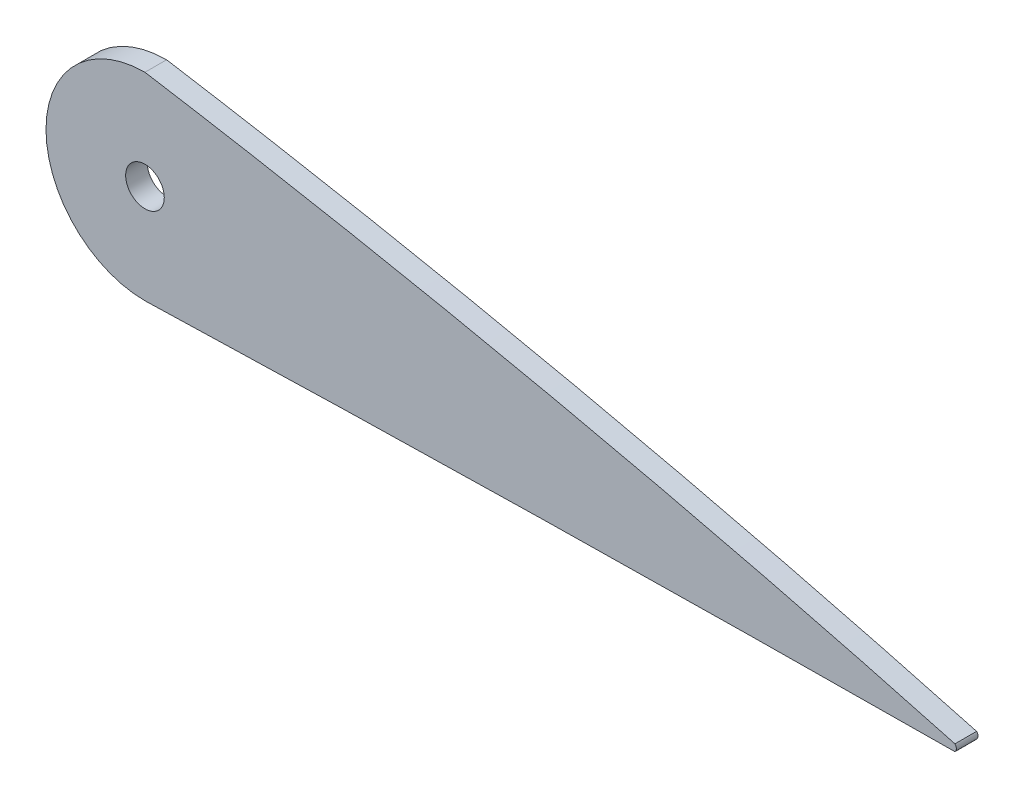
ISO-10303-21;
HEADER;
FILE_DESCRIPTION(('STEP AP214'),'2;1');
FILE_NAME('part.step','',(''),(''),'','','');
FILE_SCHEMA(('AUTOMOTIVE_DESIGN { 1 0 10303 214 1 1 1 1 }'));
ENDSEC;
DATA;
#1=APPLICATION_CONTEXT('core data for automotive mechanical design processes');
#2=APPLICATION_PROTOCOL_DEFINITION('international standard','automotive_design',2000,#1);
#3=PRODUCT_CONTEXT('',#1,'mechanical');
#4=PRODUCT('Part','Part','',(#3));
#5=PRODUCT_RELATED_PRODUCT_CATEGORY('part','',(#4));
#6=PRODUCT_DEFINITION_FORMATION('','',#4);
#7=PRODUCT_DEFINITION_CONTEXT('part definition',#1,'design');
#8=PRODUCT_DEFINITION('design','',#6,#7);
#9=PRODUCT_DEFINITION_SHAPE('','',#8);
#10=(LENGTH_UNIT() NAMED_UNIT(*) SI_UNIT(.MILLI.,.METRE.));
#11=(NAMED_UNIT(*) PLANE_ANGLE_UNIT() SI_UNIT($,.RADIAN.));
#12=(NAMED_UNIT(*) SI_UNIT($,.STERADIAN.) SOLID_ANGLE_UNIT());
#13=UNCERTAINTY_MEASURE_WITH_UNIT(LENGTH_MEASURE(1.E-05),#10,'distance_accuracy_value','');
#14=(GEOMETRIC_REPRESENTATION_CONTEXT(3) GLOBAL_UNCERTAINTY_ASSIGNED_CONTEXT((#13)) GLOBAL_UNIT_ASSIGNED_CONTEXT((#10,
#11,#12)) REPRESENTATION_CONTEXT('',''));
#15=CARTESIAN_POINT('',(0.,0.,0.));
#16=DIRECTION('',(0.,0.,1.));
#17=DIRECTION('',(1.,0.,0.));
#18=AXIS2_PLACEMENT_3D('',#15,#16,#17);
#19=CARTESIAN_POINT('',(297.585501800213,-1.05747874651129,1.4));
#20=DIRECTION('',(0.,0.,1.));
#21=DIRECTION('',(1.,0.,0.));
#22=AXIS2_PLACEMENT_3D('',#19,#20,#21);
#23=PLANE('',#22);
#24=CARTESIAN_POINT('',(245.182668181521,-2.3180775673842,1.4));
#25=CARTESIAN_POINT('',(248.299487738496,-2.22277654790756,1.4));
#26=CARTESIAN_POINT('',(254.614842100315,-2.03668245510217,1.4));
#27=CARTESIAN_POINT('',(264.128528247345,-1.77853672831656,1.4));
#28=CARTESIAN_POINT('',(273.723303234732,-1.54155803805097,1.4));
#29=CARTESIAN_POINT('',(283.317346051252,-1.32806406453034,1.4));
#30=CARTESIAN_POINT('',(292.909735843825,-1.13802167321181,1.4));
#31=CARTESIAN_POINT('',(302.493517152534,-0.971016601960476,1.4));
#32=CARTESIAN_POINT('',(312.041013984508,-0.826421033980425,1.4));
#33=CARTESIAN_POINT('',(321.464682241086,-0.704096652393016,1.4));
#34=CARTESIAN_POINT('',(330.522295395562,-0.60411986882031,1.4));
#35=CARTESIAN_POINT('',(338.773087677723,-0.527128646486028,1.4));
#36=CARTESIAN_POINT('',(345.182558015117,-0.475350240759384,1.4));
#37=CARTESIAN_POINT('',(348.76868735036,-0.449779739925354,1.4));
#38=CARTESIAN_POINT('',(350.000000000022,-0.441000000492732,1.4));
#39=B_SPLINE_CURVE_WITH_KNOTS('',3,(#24,#25,#26,#27,#28,#29,#30,#31,#32,#33,#34,#35,#36,#37,
#38),.UNSPECIFIED.,.F.,.F.,(4,1,1,1,1,1,1,1,1,1,1,1,4),(0.704555576520681,0.730918774891244,
0.757971338224895,0.785017763038357,0.812061650836911,0.839103366014866,0.866131650910678,
0.893099151655267,0.919831064622048,0.945809917390177,0.96968060086528,0.989589706283647,1.),.UNSPECIFIED.);
#40=CARTESIAN_POINT('',(245.182668181521,-2.31807756738419,1.4));
#41=VERTEX_POINT('',#40);
#42=CARTESIAN_POINT('',(350.000000000022,-0.441000000492732,1.4));
#43=VERTEX_POINT('',#42);
#44=EDGE_CURVE('E93',#41,#43,#39,.T.);
#45=ORIENTED_EDGE('',*,*,#44,.T.);
#46=CARTESIAN_POINT('',(349.559000000514,0.,1.4));
#47=DIRECTION('',(0.,0.,1.));
#48=DIRECTION('',(-1.,0.,0.));
#49=AXIS2_PLACEMENT_3D('',#46,#47,#48);
#50=CIRCLE('',#49,0.623668181006603);
#51=CARTESIAN_POINT('',(350.000000000022,0.441000000492733,1.4));
#52=VERTEX_POINT('',#51);
#53=EDGE_CURVE('E88',#43,#52,#50,.T.);
#54=ORIENTED_EDGE('',*,*,#53,.T.);
#55=CARTESIAN_POINT('',(350.000000000022,0.441000000492668,1.4));
#56=CARTESIAN_POINT('',(348.817934835742,0.763027745461311,1.4));
#57=CARTESIAN_POINT('',(345.408245976701,1.6919227400027,1.4));
#58=CARTESIAN_POINT('',(339.347864916678,3.30167467413605,1.4));
#59=CARTESIAN_POINT('',(331.589665686033,5.30267551070909,1.4));
#60=CARTESIAN_POINT('',(323.091885591122,7.41721237259971,1.4));
#61=CARTESIAN_POINT('',(314.238285126452,9.53801243910672,1.4));
#62=CARTESIAN_POINT('',(305.242760893929,11.6082548858533,1.4));
#63=CARTESIAN_POINT('',(296.187367062447,13.6076290796534,1.4));
#64=CARTESIAN_POINT('',(287.101376112556,15.5293249058001,1.4));
#65=CARTESIAN_POINT('',(277.995159277712,17.3709910173176,1.4));
#66=CARTESIAN_POINT('',(268.873317878915,19.1314170937346,1.4));
#67=CARTESIAN_POINT('',(259.73866796193,20.8097306246715,1.4));
#68=CARTESIAN_POINT('',(251.840157461766,22.1873296101187,1.4));
#69=CARTESIAN_POINT('',(246.985652295943,22.9977565782531,1.4));
#70=CARTESIAN_POINT('',(245.182668181521,23.2937088102937,1.4));
#71=B_SPLINE_CURVE_WITH_KNOTS('',3,(#55,#56,#57,#58,#59,#60,#61,#62,#63,#64,#65,#66,#67,#68,#69,
#70),.UNSPECIFIED.,.F.,.F.,(4,1,1,1,1,1,1,1,1,1,1,1,1,4),(0.,0.0101621996718151,
0.029313053164405,0.0520116049167945,0.0766194676467142,0.101948061207292,0.127526131749972,
0.153184130655642,0.178867887696566,0.204557902716051,0.230245711588722,0.255925967287604,
0.281594302232909,0.296749598126579),.UNSPECIFIED.);
#72=CARTESIAN_POINT('',(245.182668181521,23.2937088102937,1.4));
#73=VERTEX_POINT('',#72);
#74=EDGE_CURVE('E91',#52,#73,#71,.T.);
#75=ORIENTED_EDGE('',*,*,#74,.T.);
#76=CARTESIAN_POINT('',(245.182668181521,10.487815621454,1.4));
#77=DIRECTION('',(0.,0.,1.));
#78=DIRECTION('',(1.,0.,0.));
#79=AXIS2_PLACEMENT_3D('',#76,#77,#78);
#80=CIRCLE('',#79,12.8058931888382);
#81=EDGE_CURVE('E58',#73,#41,#80,.T.);
#82=ORIENTED_EDGE('',*,*,#81,.T.);
#83=EDGE_LOOP('',(#45,#54,#75,#82));
#84=FACE_BOUND('',#83,.T.);
#85=CARTESIAN_POINT('',(245.182668181521,10.487815621454,1.4));
#86=DIRECTION('',(0.,0.,1.));
#87=DIRECTION('',(1.,0.,0.));
#88=AXIS2_PLACEMENT_3D('',#85,#86,#87);
#89=CIRCLE('',#88,2.5);
#90=CARTESIAN_POINT('',(247.682668181521,10.487815621454,1.4));
#91=VERTEX_POINT('',#90);
#92=EDGE_CURVE('E141',#91,#91,#89,.T.);
#93=ORIENTED_EDGE('',*,*,#92,.F.);
#94=EDGE_LOOP('',(#93));
#95=FACE_BOUND('',#94,.T.);
#96=ADVANCED_FACE('F39',(#84,#95),#23,.T.);
#97=CARTESIAN_POINT('',(297.585501800213,-1.05747874651129,-1.4));
#98=DIRECTION('',(0.,0.,1.));
#99=DIRECTION('',(1.,0.,0.));
#100=AXIS2_PLACEMENT_3D('',#97,#98,#99);
#101=PLANE('',#100);
#102=CARTESIAN_POINT('',(245.182668181521,-2.3180775673842,-1.4));
#103=CARTESIAN_POINT('',(248.299487738496,-2.22277654790756,-1.4));
#104=CARTESIAN_POINT('',(254.614842100315,-2.03668245510217,-1.4));
#105=CARTESIAN_POINT('',(264.128528247345,-1.77853672831656,-1.4));
#106=CARTESIAN_POINT('',(273.723303234732,-1.54155803805097,-1.4));
#107=CARTESIAN_POINT('',(283.317346051252,-1.32806406453034,-1.4));
#108=CARTESIAN_POINT('',(292.909735843825,-1.13802167321181,-1.4));
#109=CARTESIAN_POINT('',(302.493517152534,-0.971016601960476,-1.4));
#110=CARTESIAN_POINT('',(312.041013984508,-0.826421033980425,-1.4));
#111=CARTESIAN_POINT('',(321.464682241086,-0.704096652393016,-1.4));
#112=CARTESIAN_POINT('',(330.522295395562,-0.60411986882031,-1.4));
#113=CARTESIAN_POINT('',(338.773087677723,-0.527128646486028,-1.4));
#114=CARTESIAN_POINT('',(345.182558015117,-0.475350240759384,-1.4));
#115=CARTESIAN_POINT('',(348.76868735036,-0.449779739925354,-1.4));
#116=CARTESIAN_POINT('',(350.000000000022,-0.441000000492732,-1.4));
#117=B_SPLINE_CURVE_WITH_KNOTS('',3,(#102,#103,#104,#105,#106,#107,#108,#109,#110,#111,#112,
#113,#114,#115,#116),.UNSPECIFIED.,.F.,.F.,(4,1,1,1,1,1,1,1,1,1,1,1,4),(0.704555576520681,
0.730918774891244,0.757971338224895,0.785017763038357,0.812061650836911,0.839103366014866,
0.866131650910678,0.893099151655267,0.919831064622048,0.945809917390177,0.96968060086528,
0.989589706283647,1.),.UNSPECIFIED.);
#118=CARTESIAN_POINT('',(245.182668181521,-2.31807756738419,-1.4));
#119=VERTEX_POINT('',#118);
#120=CARTESIAN_POINT('',(350.000000000022,-0.441000000492732,-1.4));
#121=VERTEX_POINT('',#120);
#122=EDGE_CURVE('E149',#119,#121,#117,.T.);
#123=ORIENTED_EDGE('',*,*,#122,.F.);
#124=CARTESIAN_POINT('',(245.182668181521,10.487815621454,-1.4));
#125=DIRECTION('',(0.,0.,1.));
#126=DIRECTION('',(1.,0.,0.));
#127=AXIS2_PLACEMENT_3D('',#124,#125,#126);
#128=CIRCLE('',#127,12.8058931888382);
#129=CARTESIAN_POINT('',(245.182668181521,23.2937088102937,-1.4));
#130=VERTEX_POINT('',#129);
#131=EDGE_CURVE('E81',#130,#119,#128,.T.);
#132=ORIENTED_EDGE('',*,*,#131,.F.);
#133=CARTESIAN_POINT('',(350.000000000022,0.441000000492668,-1.4));
#134=CARTESIAN_POINT('',(348.817934835742,0.763027745461311,-1.4));
#135=CARTESIAN_POINT('',(345.408245976701,1.6919227400027,-1.4));
#136=CARTESIAN_POINT('',(339.347864916678,3.30167467413605,-1.4));
#137=CARTESIAN_POINT('',(331.589665686033,5.30267551070909,-1.4));
#138=CARTESIAN_POINT('',(323.091885591122,7.41721237259971,-1.4));
#139=CARTESIAN_POINT('',(314.238285126452,9.53801243910672,-1.4));
#140=CARTESIAN_POINT('',(305.242760893929,11.6082548858533,-1.4));
#141=CARTESIAN_POINT('',(296.187367062447,13.6076290796534,-1.4));
#142=CARTESIAN_POINT('',(287.101376112556,15.5293249058001,-1.4));
#143=CARTESIAN_POINT('',(277.995159277712,17.3709910173176,-1.4));
#144=CARTESIAN_POINT('',(268.873317878915,19.1314170937346,-1.4));
#145=CARTESIAN_POINT('',(259.73866796193,20.8097306246715,-1.4));
#146=CARTESIAN_POINT('',(251.840157461766,22.1873296101187,-1.4));
#147=CARTESIAN_POINT('',(246.985652295943,22.9977565782531,-1.4));
#148=CARTESIAN_POINT('',(245.182668181521,23.2937088102937,-1.4));
#149=B_SPLINE_CURVE_WITH_KNOTS('',3,(#133,#134,#135,#136,#137,#138,#139,#140,#141,#142,#143,
#144,#145,#146,#147,#148),.UNSPECIFIED.,.F.,.F.,(4,1,1,1,1,1,1,1,1,1,1,1,1,4),(0.,
0.0101621996718151,0.029313053164405,0.0520116049167945,0.0766194676467142,0.101948061207292,
0.127526131749972,0.153184130655642,0.178867887696566,0.204557902716051,0.230245711588722,
0.255925967287604,0.281594302232909,0.296749598126579),.UNSPECIFIED.);
#150=CARTESIAN_POINT('',(350.000000000022,0.441000000492733,-1.4));
#151=VERTEX_POINT('',#150);
#152=EDGE_CURVE('E75',#151,#130,#149,.T.);
#153=ORIENTED_EDGE('',*,*,#152,.F.);
#154=CARTESIAN_POINT('',(349.559000000514,0.,-1.4));
#155=DIRECTION('',(0.,0.,1.));
#156=DIRECTION('',(-1.,0.,0.));
#157=AXIS2_PLACEMENT_3D('',#154,#155,#156);
#158=CIRCLE('',#157,0.623668181006603);
#159=EDGE_CURVE('E98',#121,#151,#158,.T.);
#160=ORIENTED_EDGE('',*,*,#159,.F.);
#161=EDGE_LOOP('',(#123,#132,#153,#160));
#162=FACE_BOUND('',#161,.T.);
#163=CARTESIAN_POINT('',(245.182668181521,10.487815621454,-1.4));
#164=DIRECTION('',(0.,0.,1.));
#165=DIRECTION('',(1.,0.,0.));
#166=AXIS2_PLACEMENT_3D('',#163,#164,#165);
#167=CIRCLE('',#166,2.5);
#168=CARTESIAN_POINT('',(247.682668181521,10.487815621454,-1.4));
#169=VERTEX_POINT('',#168);
#170=EDGE_CURVE('E144',#169,#169,#167,.T.);
#171=ORIENTED_EDGE('',*,*,#170,.T.);
#172=EDGE_LOOP('',(#171));
#173=FACE_BOUND('',#172,.T.);
#174=ADVANCED_FACE('F123',(#162,#173),#101,.F.);
#175=DIRECTION('',(0.,0.,-1.));
#176=VECTOR('',#175,1.);
#177=SURFACE_OF_LINEAR_EXTRUSION('',#39,#176);
#178=ORIENTED_EDGE('',*,*,#122,.T.);
#179=DIRECTION('',(0.,0.,-1.));
#180=VECTOR('',#179,1.);
#181=CARTESIAN_POINT('',(350.000000000022,-0.441000000492732,1.4));
#182=LINE('',#181,#180);
#183=EDGE_CURVE('E11',#43,#121,#182,.T.);
#184=ORIENTED_EDGE('',*,*,#183,.F.);
#185=ORIENTED_EDGE('',*,*,#44,.F.);
#186=DIRECTION('',(0.,0.,-1.));
#187=VECTOR('',#186,1.);
#188=CARTESIAN_POINT('',(245.182668181521,-2.31807756738419,1.4));
#189=LINE('',#188,#187);
#190=EDGE_CURVE('E105',#41,#119,#189,.T.);
#191=ORIENTED_EDGE('',*,*,#190,.T.);
#192=EDGE_LOOP('',(#178,#184,#185,#191));
#193=FACE_BOUND('',#192,.T.);
#194=ADVANCED_FACE('F41',(#193),#177,.F.);
#195=CARTESIAN_POINT('',(349.559000000514,0.,1.4));
#196=DIRECTION('',(0.,0.,-1.));
#197=DIRECTION('',(-1.,0.,0.));
#198=AXIS2_PLACEMENT_3D('',#195,#196,#197);
#199=CYLINDRICAL_SURFACE('',#198,0.623668181006603);
#200=ORIENTED_EDGE('',*,*,#159,.T.);
#201=DIRECTION('',(0.,0.,-1.));
#202=VECTOR('',#201,1.);
#203=CARTESIAN_POINT('',(350.000000000022,0.441000000492733,1.4));
#204=LINE('',#203,#202);
#205=EDGE_CURVE('E50',#52,#151,#204,.T.);
#206=ORIENTED_EDGE('',*,*,#205,.F.);
#207=ORIENTED_EDGE('',*,*,#53,.F.);
#208=ORIENTED_EDGE('',*,*,#183,.T.);
#209=EDGE_LOOP('',(#200,#206,#207,#208));
#210=FACE_BOUND('',#209,.T.);
#211=ADVANCED_FACE('F97',(#210),#199,.T.);
#212=DIRECTION('',(0.,0.,-1.));
#213=VECTOR('',#212,1.);
#214=SURFACE_OF_LINEAR_EXTRUSION('',#71,#213);
#215=ORIENTED_EDGE('',*,*,#152,.T.);
#216=DIRECTION('',(0.,0.,-1.));
#217=VECTOR('',#216,1.);
#218=CARTESIAN_POINT('',(245.182668181521,23.2937088102937,1.4));
#219=LINE('',#218,#217);
#220=EDGE_CURVE('E100',#73,#130,#219,.T.);
#221=ORIENTED_EDGE('',*,*,#220,.F.);
#222=ORIENTED_EDGE('',*,*,#74,.F.);
#223=ORIENTED_EDGE('',*,*,#205,.T.);
#224=EDGE_LOOP('',(#215,#221,#222,#223));
#225=FACE_BOUND('',#224,.T.);
#226=ADVANCED_FACE('F101',(#225),#214,.F.);
#227=CARTESIAN_POINT('',(245.182668181521,10.487815621454,1.4));
#228=DIRECTION('',(0.,0.,-1.));
#229=DIRECTION('',(-1.,0.,0.));
#230=AXIS2_PLACEMENT_3D('',#227,#228,#229);
#231=CYLINDRICAL_SURFACE('',#230,12.8058931888382);
#232=ORIENTED_EDGE('',*,*,#131,.T.);
#233=ORIENTED_EDGE('',*,*,#190,.F.);
#234=ORIENTED_EDGE('',*,*,#81,.F.);
#235=ORIENTED_EDGE('',*,*,#220,.T.);
#236=EDGE_LOOP('',(#232,#233,#234,#235));
#237=FACE_BOUND('',#236,.T.);
#238=ADVANCED_FACE('F117',(#237),#231,.T.);
#239=CARTESIAN_POINT('',(245.182668181521,10.487815621454,1.4));
#240=DIRECTION('',(0.,0.,-1.));
#241=DIRECTION('',(-1.,0.,0.));
#242=AXIS2_PLACEMENT_3D('',#239,#240,#241);
#243=CYLINDRICAL_SURFACE('',#242,2.5);
#244=ORIENTED_EDGE('',*,*,#92,.T.);
#245=EDGE_LOOP('',(#244));
#246=FACE_BOUND('',#245,.T.);
#247=ORIENTED_EDGE('',*,*,#170,.F.);
#248=EDGE_LOOP('',(#247));
#249=FACE_BOUND('',#248,.T.);
#250=ADVANCED_FACE('F132',(#246,#249),#243,.F.);
#251=CLOSED_SHELL('',(#96,#174,#194,#211,#226,#238,#250));
#252=MANIFOLD_SOLID_BREP('B2',#251);
#253=ADVANCED_BREP_SHAPE_REPRESENTATION('',(#18,#252),#14);
#254=SHAPE_DEFINITION_REPRESENTATION(#9,#253);
ENDSEC;
END-ISO-10303-21;
